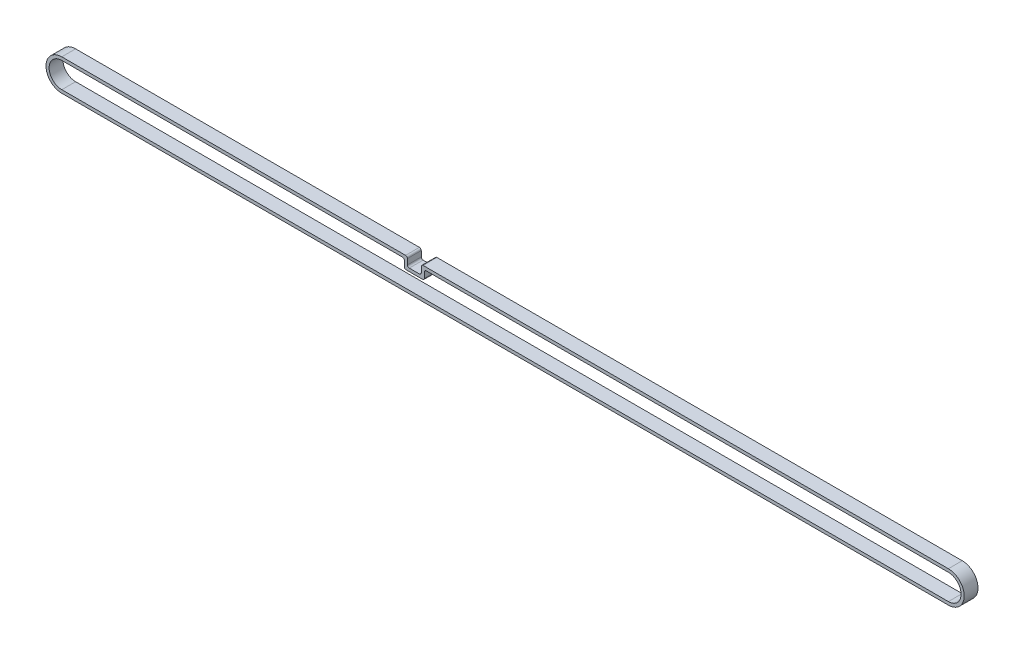
ISO-10303-21;
HEADER;
FILE_DESCRIPTION(('STEP AP214'),'2;1');
FILE_NAME('part.step','',(''),(''),'','','');
FILE_SCHEMA(('AUTOMOTIVE_DESIGN { 1 0 10303 214 1 1 1 1 }'));
ENDSEC;
DATA;
#1=APPLICATION_CONTEXT('core data for automotive mechanical design processes');
#2=APPLICATION_PROTOCOL_DEFINITION('international standard','automotive_design',2000,#1);
#3=PRODUCT_CONTEXT('',#1,'mechanical');
#4=PRODUCT('Part','Part','',(#3));
#5=PRODUCT_RELATED_PRODUCT_CATEGORY('part','',(#4));
#6=PRODUCT_DEFINITION_FORMATION('','',#4);
#7=PRODUCT_DEFINITION_CONTEXT('part definition',#1,'design');
#8=PRODUCT_DEFINITION('design','',#6,#7);
#9=PRODUCT_DEFINITION_SHAPE('','',#8);
#10=(LENGTH_UNIT() NAMED_UNIT(*) SI_UNIT(.MILLI.,.METRE.));
#11=(NAMED_UNIT(*) PLANE_ANGLE_UNIT() SI_UNIT($,.RADIAN.));
#12=(NAMED_UNIT(*) SI_UNIT($,.STERADIAN.) SOLID_ANGLE_UNIT());
#13=UNCERTAINTY_MEASURE_WITH_UNIT(LENGTH_MEASURE(1.E-05),#10,'distance_accuracy_value','');
#14=(GEOMETRIC_REPRESENTATION_CONTEXT(3) GLOBAL_UNCERTAINTY_ASSIGNED_CONTEXT((#13)) GLOBAL_UNIT_ASSIGNED_CONTEXT((#10,
#11,#12)) REPRESENTATION_CONTEXT('',''));
#15=CARTESIAN_POINT('',(0.,0.,0.));
#16=DIRECTION('',(0.,0.,1.));
#17=DIRECTION('',(1.,0.,0.));
#18=AXIS2_PLACEMENT_3D('',#15,#16,#17);
#19=CARTESIAN_POINT('',(0.,0.,6.));
#20=DIRECTION('',(0.,0.,1.));
#21=DIRECTION('',(1.,0.,0.));
#22=AXIS2_PLACEMENT_3D('',#19,#20,#21);
#23=PLANE('',#22);
#24=DIRECTION('',(-1.,0.,0.));
#25=VECTOR('',#24,1.);
#26=CARTESIAN_POINT('',(156.,6.85,6.));
#27=LINE('',#26,#25);
#28=CARTESIAN_POINT('',(384.75,6.85,6.));
#29=VERTEX_POINT('',#28);
#30=CARTESIAN_POINT('',(156.8,6.85,6.));
#31=VERTEX_POINT('',#30);
#32=EDGE_CURVE('E271',#29,#31,#27,.T.);
#33=ORIENTED_EDGE('',*,*,#32,.T.);
#34=CARTESIAN_POINT('',(156.8,6.05,6.));
#35=DIRECTION('',(0.,0.,1.));
#36=DIRECTION('',(1.,0.,0.));
#37=AXIS2_PLACEMENT_3D('',#34,#35,#36);
#38=CIRCLE('',#37,0.8);
#39=CARTESIAN_POINT('',(156.,6.05,6.));
#40=VERTEX_POINT('',#39);
#41=EDGE_CURVE('E343',#31,#40,#38,.T.);
#42=ORIENTED_EDGE('',*,*,#41,.T.);
#43=DIRECTION('',(0.,-1.,0.));
#44=VECTOR('',#43,1.);
#45=CARTESIAN_POINT('',(156.,2.85,6.));
#46=LINE('',#45,#44);
#47=CARTESIAN_POINT('',(156.,3.65,6.));
#48=VERTEX_POINT('',#47);
#49=EDGE_CURVE('E274',#40,#48,#46,.T.);
#50=ORIENTED_EDGE('',*,*,#49,.T.);
#51=CARTESIAN_POINT('',(155.2,3.65,6.));
#52=DIRECTION('',(0.,0.,1.));
#53=DIRECTION('',(1.,0.,0.));
#54=AXIS2_PLACEMENT_3D('',#51,#52,#53);
#55=CIRCLE('',#54,0.8);
#56=CARTESIAN_POINT('',(155.2,2.85,6.));
#57=VERTEX_POINT('',#56);
#58=EDGE_CURVE('E378',#48,#57,#55,.F.);
#59=ORIENTED_EDGE('',*,*,#58,.T.);
#60=DIRECTION('',(-1.,0.,0.));
#61=VECTOR('',#60,1.);
#62=CARTESIAN_POINT('',(150.,2.85,6.));
#63=LINE('',#62,#61);
#64=CARTESIAN_POINT('',(150.8,2.85,6.));
#65=VERTEX_POINT('',#64);
#66=EDGE_CURVE('E277',#57,#65,#63,.T.);
#67=ORIENTED_EDGE('',*,*,#66,.T.);
#68=CARTESIAN_POINT('',(150.8,3.65,6.));
#69=DIRECTION('',(0.,0.,1.));
#70=DIRECTION('',(1.,0.,0.));
#71=AXIS2_PLACEMENT_3D('',#68,#69,#70);
#72=CIRCLE('',#71,0.8);
#73=CARTESIAN_POINT('',(150.,3.65,6.));
#74=VERTEX_POINT('',#73);
#75=EDGE_CURVE('E11',#65,#74,#72,.F.);
#76=ORIENTED_EDGE('',*,*,#75,.T.);
#77=DIRECTION('',(0.,1.,0.));
#78=VECTOR('',#77,1.);
#79=CARTESIAN_POINT('',(150.,2.85,6.));
#80=LINE('',#79,#78);
#81=CARTESIAN_POINT('',(150.,6.05,6.));
#82=VERTEX_POINT('',#81);
#83=EDGE_CURVE('E280',#74,#82,#80,.T.);
#84=ORIENTED_EDGE('',*,*,#83,.T.);
#85=CARTESIAN_POINT('',(149.2,6.05,6.));
#86=DIRECTION('',(0.,0.,1.));
#87=DIRECTION('',(1.,0.,0.));
#88=AXIS2_PLACEMENT_3D('',#85,#86,#87);
#89=CIRCLE('',#88,0.8);
#90=CARTESIAN_POINT('',(149.2,6.85,6.));
#91=VERTEX_POINT('',#90);
#92=EDGE_CURVE('E49',#82,#91,#89,.T.);
#93=ORIENTED_EDGE('',*,*,#92,.T.);
#94=DIRECTION('',(-1.,0.,0.));
#95=VECTOR('',#94,1.);
#96=CARTESIAN_POINT('',(0.,6.85,6.));
#97=LINE('',#96,#95);
#98=CARTESIAN_POINT('',(0.,6.85,6.));
#99=VERTEX_POINT('',#98);
#100=EDGE_CURVE('E282',#91,#99,#97,.T.);
#101=ORIENTED_EDGE('',*,*,#100,.T.);
#102=CARTESIAN_POINT('',(0.,0.,6.));
#103=DIRECTION('',(0.,0.,1.));
#104=DIRECTION('',(1.,0.,0.));
#105=AXIS2_PLACEMENT_3D('',#102,#103,#104);
#106=CIRCLE('',#105,6.85);
#107=CARTESIAN_POINT('',(0.,-6.85,6.));
#108=VERTEX_POINT('',#107);
#109=EDGE_CURVE('E263',#99,#108,#106,.T.);
#110=ORIENTED_EDGE('',*,*,#109,.T.);
#111=DIRECTION('',(1.,0.,0.));
#112=VECTOR('',#111,1.);
#113=CARTESIAN_POINT('',(0.,-6.85,6.));
#114=LINE('',#113,#112);
#115=CARTESIAN_POINT('',(384.75,-6.85,6.));
#116=VERTEX_POINT('',#115);
#117=EDGE_CURVE('E266',#108,#116,#114,.T.);
#118=ORIENTED_EDGE('',*,*,#117,.T.);
#119=CARTESIAN_POINT('',(384.75,0.,6.));
#120=DIRECTION('',(0.,0.,1.));
#121=DIRECTION('',(-1.,0.,0.));
#122=AXIS2_PLACEMENT_3D('',#119,#120,#121);
#123=CIRCLE('',#122,6.85);
#124=EDGE_CURVE('E269',#116,#29,#123,.T.);
#125=ORIENTED_EDGE('',*,*,#124,.T.);
#126=EDGE_LOOP('',(#33,#42,#50,#59,#67,#76,#84,#93,#101,#110,#118,#125));
#127=FACE_BOUND('',#126,.T.);
#128=DIRECTION('',(0.,1.,0.));
#129=VECTOR('',#128,1.);
#130=CARTESIAN_POINT('',(148.65,5.5,6.));
#131=LINE('',#130,#129);
#132=CARTESIAN_POINT('',(148.65,2.3,6.));
#133=VERTEX_POINT('',#132);
#134=CARTESIAN_POINT('',(148.65,4.7,6.));
#135=VERTEX_POINT('',#134);
#136=EDGE_CURVE('E235',#133,#135,#131,.T.);
#137=ORIENTED_EDGE('',*,*,#136,.F.);
#138=CARTESIAN_POINT('',(149.45,2.3,6.));
#139=DIRECTION('',(0.,0.,1.));
#140=DIRECTION('',(1.,0.,0.));
#141=AXIS2_PLACEMENT_3D('',#138,#139,#140);
#142=CIRCLE('',#141,0.8);
#143=CARTESIAN_POINT('',(149.45,1.5,6.));
#144=VERTEX_POINT('',#143);
#145=EDGE_CURVE('E347',#133,#144,#142,.T.);
#146=ORIENTED_EDGE('',*,*,#145,.T.);
#147=DIRECTION('',(-1.,0.,0.));
#148=VECTOR('',#147,1.);
#149=CARTESIAN_POINT('',(148.65,1.5,6.));
#150=LINE('',#149,#148);
#151=CARTESIAN_POINT('',(156.55,1.5,6.));
#152=VERTEX_POINT('',#151);
#153=EDGE_CURVE('E232',#152,#144,#150,.T.);
#154=ORIENTED_EDGE('',*,*,#153,.F.);
#155=CARTESIAN_POINT('',(156.55,2.3,6.));
#156=DIRECTION('',(0.,0.,1.));
#157=DIRECTION('',(1.,0.,0.));
#158=AXIS2_PLACEMENT_3D('',#155,#156,#157);
#159=CIRCLE('',#158,0.8);
#160=CARTESIAN_POINT('',(157.35,2.3,6.));
#161=VERTEX_POINT('',#160);
#162=EDGE_CURVE('E345',#152,#161,#159,.T.);
#163=ORIENTED_EDGE('',*,*,#162,.T.);
#164=DIRECTION('',(0.,-1.,0.));
#165=VECTOR('',#164,1.);
#166=CARTESIAN_POINT('',(157.35,1.5,6.));
#167=LINE('',#166,#165);
#168=CARTESIAN_POINT('',(157.35,4.7,6.));
#169=VERTEX_POINT('',#168);
#170=EDGE_CURVE('E229',#169,#161,#167,.T.);
#171=ORIENTED_EDGE('',*,*,#170,.F.);
#172=CARTESIAN_POINT('',(158.15,4.7,6.));
#173=DIRECTION('',(0.,0.,1.));
#174=DIRECTION('',(1.,0.,0.));
#175=AXIS2_PLACEMENT_3D('',#172,#173,#174);
#176=CIRCLE('',#175,0.8);
#177=CARTESIAN_POINT('',(158.15,5.5,6.));
#178=VERTEX_POINT('',#177);
#179=EDGE_CURVE('E370',#169,#178,#176,.F.);
#180=ORIENTED_EDGE('',*,*,#179,.T.);
#181=DIRECTION('',(-1.,0.,0.));
#182=VECTOR('',#181,1.);
#183=CARTESIAN_POINT('',(157.35,5.5,6.));
#184=LINE('',#183,#182);
#185=CARTESIAN_POINT('',(384.75,5.5,6.));
#186=VERTEX_POINT('',#185);
#187=EDGE_CURVE('E224',#186,#178,#184,.T.);
#188=ORIENTED_EDGE('',*,*,#187,.F.);
#189=CARTESIAN_POINT('',(384.75,0.,6.));
#190=DIRECTION('',(0.,0.,1.));
#191=DIRECTION('',(-1.,0.,0.));
#192=AXIS2_PLACEMENT_3D('',#189,#190,#191);
#193=CIRCLE('',#192,5.5);
#194=CARTESIAN_POINT('',(384.75,-5.5,6.));
#195=VERTEX_POINT('',#194);
#196=EDGE_CURVE('E222',#195,#186,#193,.T.);
#197=ORIENTED_EDGE('',*,*,#196,.F.);
#198=DIRECTION('',(1.,0.,0.));
#199=VECTOR('',#198,1.);
#200=CARTESIAN_POINT('',(0.,-5.5,6.));
#201=LINE('',#200,#199);
#202=CARTESIAN_POINT('',(0.,-5.5,6.));
#203=VERTEX_POINT('',#202);
#204=EDGE_CURVE('E208',#203,#195,#201,.T.);
#205=ORIENTED_EDGE('',*,*,#204,.F.);
#206=CARTESIAN_POINT('',(0.,0.,6.));
#207=DIRECTION('',(0.,0.,1.));
#208=DIRECTION('',(1.,0.,0.));
#209=AXIS2_PLACEMENT_3D('',#206,#207,#208);
#210=CIRCLE('',#209,5.5);
#211=CARTESIAN_POINT('',(0.,5.5,6.));
#212=VERTEX_POINT('',#211);
#213=EDGE_CURVE('E197',#212,#203,#210,.T.);
#214=ORIENTED_EDGE('',*,*,#213,.F.);
#215=DIRECTION('',(-1.,0.,0.));
#216=VECTOR('',#215,1.);
#217=CARTESIAN_POINT('',(0.,5.5,6.));
#218=LINE('',#217,#216);
#219=CARTESIAN_POINT('',(147.85,5.5,6.));
#220=VERTEX_POINT('',#219);
#221=EDGE_CURVE('E238',#220,#212,#218,.T.);
#222=ORIENTED_EDGE('',*,*,#221,.F.);
#223=CARTESIAN_POINT('',(147.85,4.7,6.));
#224=DIRECTION('',(0.,0.,1.));
#225=DIRECTION('',(1.,0.,0.));
#226=AXIS2_PLACEMENT_3D('',#223,#224,#225);
#227=CIRCLE('',#226,0.8);
#228=EDGE_CURVE('E374',#220,#135,#227,.F.);
#229=ORIENTED_EDGE('',*,*,#228,.T.);
#230=EDGE_LOOP('',(#137,#146,#154,#163,#171,#180,#188,#197,#205,#214,#222,#229));
#231=FACE_BOUND('',#230,.T.);
#232=ADVANCED_FACE('F34',(#127,#231),#23,.T.);
#233=CARTESIAN_POINT('',(0.,0.,0.));
#234=DIRECTION('',(0.,0.,1.));
#235=DIRECTION('',(1.,0.,0.));
#236=AXIS2_PLACEMENT_3D('',#233,#234,#235);
#237=PLANE('',#236);
#238=DIRECTION('',(0.,-1.,0.));
#239=VECTOR('',#238,1.);
#240=CARTESIAN_POINT('',(156.,2.85,0.));
#241=LINE('',#240,#239);
#242=CARTESIAN_POINT('',(156.,6.05,0.));
#243=VERTEX_POINT('',#242);
#244=CARTESIAN_POINT('',(156.,3.65,0.));
#245=VERTEX_POINT('',#244);
#246=EDGE_CURVE('E294',#243,#245,#241,.T.);
#247=ORIENTED_EDGE('',*,*,#246,.F.);
#248=CARTESIAN_POINT('',(156.8,6.05,0.));
#249=DIRECTION('',(0.,0.,1.));
#250=DIRECTION('',(1.,0.,0.));
#251=AXIS2_PLACEMENT_3D('',#248,#249,#250);
#252=CIRCLE('',#251,0.8);
#253=CARTESIAN_POINT('',(156.8,6.85,0.));
#254=VERTEX_POINT('',#253);
#255=EDGE_CURVE('E336',#243,#254,#252,.F.);
#256=ORIENTED_EDGE('',*,*,#255,.T.);
#257=DIRECTION('',(-1.,0.,0.));
#258=VECTOR('',#257,1.);
#259=CARTESIAN_POINT('',(156.,6.85,0.));
#260=LINE('',#259,#258);
#261=CARTESIAN_POINT('',(384.75,6.85,0.));
#262=VERTEX_POINT('',#261);
#263=EDGE_CURVE('E291',#262,#254,#260,.T.);
#264=ORIENTED_EDGE('',*,*,#263,.F.);
#265=CARTESIAN_POINT('',(384.75,0.,0.));
#266=DIRECTION('',(0.,0.,1.));
#267=DIRECTION('',(-1.,0.,0.));
#268=AXIS2_PLACEMENT_3D('',#265,#266,#267);
#269=CIRCLE('',#268,6.85);
#270=CARTESIAN_POINT('',(384.75,-6.85,0.));
#271=VERTEX_POINT('',#270);
#272=EDGE_CURVE('E289',#271,#262,#269,.T.);
#273=ORIENTED_EDGE('',*,*,#272,.F.);
#274=DIRECTION('',(1.,0.,0.));
#275=VECTOR('',#274,1.);
#276=CARTESIAN_POINT('',(0.,-6.85,0.));
#277=LINE('',#276,#275);
#278=CARTESIAN_POINT('',(0.,-6.85,0.));
#279=VERTEX_POINT('',#278);
#280=EDGE_CURVE('E287',#279,#271,#277,.T.);
#281=ORIENTED_EDGE('',*,*,#280,.F.);
#282=CARTESIAN_POINT('',(0.,0.,0.));
#283=DIRECTION('',(0.,0.,1.));
#284=DIRECTION('',(1.,0.,0.));
#285=AXIS2_PLACEMENT_3D('',#282,#283,#284);
#286=CIRCLE('',#285,6.85);
#287=CARTESIAN_POINT('',(0.,6.85,0.));
#288=VERTEX_POINT('',#287);
#289=EDGE_CURVE('E216',#288,#279,#286,.T.);
#290=ORIENTED_EDGE('',*,*,#289,.F.);
#291=DIRECTION('',(-1.,0.,0.));
#292=VECTOR('',#291,1.);
#293=CARTESIAN_POINT('',(0.,6.85,0.));
#294=LINE('',#293,#292);
#295=CARTESIAN_POINT('',(149.2,6.85,0.));
#296=VERTEX_POINT('',#295);
#297=EDGE_CURVE('E267',#296,#288,#294,.T.);
#298=ORIENTED_EDGE('',*,*,#297,.F.);
#299=CARTESIAN_POINT('',(149.2,6.05,0.));
#300=DIRECTION('',(0.,0.,1.));
#301=DIRECTION('',(1.,0.,0.));
#302=AXIS2_PLACEMENT_3D('',#299,#300,#301);
#303=CIRCLE('',#302,0.8);
#304=CARTESIAN_POINT('',(150.,6.05,0.));
#305=VERTEX_POINT('',#304);
#306=EDGE_CURVE('E334',#296,#305,#303,.F.);
#307=ORIENTED_EDGE('',*,*,#306,.T.);
#308=DIRECTION('',(0.,1.,0.));
#309=VECTOR('',#308,1.);
#310=CARTESIAN_POINT('',(150.,2.85,0.));
#311=LINE('',#310,#309);
#312=CARTESIAN_POINT('',(150.,3.65,0.));
#313=VERTEX_POINT('',#312);
#314=EDGE_CURVE('E300',#313,#305,#311,.T.);
#315=ORIENTED_EDGE('',*,*,#314,.F.);
#316=CARTESIAN_POINT('',(150.8,3.65,0.));
#317=DIRECTION('',(0.,0.,1.));
#318=DIRECTION('',(1.,0.,0.));
#319=AXIS2_PLACEMENT_3D('',#316,#317,#318);
#320=CIRCLE('',#319,0.8);
#321=CARTESIAN_POINT('',(150.8,2.85,0.));
#322=VERTEX_POINT('',#321);
#323=EDGE_CURVE('E42',#313,#322,#320,.T.);
#324=ORIENTED_EDGE('',*,*,#323,.T.);
#325=DIRECTION('',(-1.,0.,0.));
#326=VECTOR('',#325,1.);
#327=CARTESIAN_POINT('',(150.,2.85,0.));
#328=LINE('',#327,#326);
#329=CARTESIAN_POINT('',(155.2,2.85,0.));
#330=VERTEX_POINT('',#329);
#331=EDGE_CURVE('E297',#330,#322,#328,.T.);
#332=ORIENTED_EDGE('',*,*,#331,.F.);
#333=CARTESIAN_POINT('',(155.2,3.65,0.));
#334=DIRECTION('',(0.,0.,1.));
#335=DIRECTION('',(1.,0.,0.));
#336=AXIS2_PLACEMENT_3D('',#333,#334,#335);
#337=CIRCLE('',#336,0.8);
#338=EDGE_CURVE('E376',#330,#245,#337,.T.);
#339=ORIENTED_EDGE('',*,*,#338,.T.);
#340=EDGE_LOOP('',(#247,#256,#264,#273,#281,#290,#298,#307,#315,#324,#332,#339));
#341=FACE_BOUND('',#340,.T.);
#342=DIRECTION('',(-1.,0.,0.));
#343=VECTOR('',#342,1.);
#344=CARTESIAN_POINT('',(148.65,1.5,0.));
#345=LINE('',#344,#343);
#346=CARTESIAN_POINT('',(156.55,1.5,0.));
#347=VERTEX_POINT('',#346);
#348=CARTESIAN_POINT('',(149.45,1.5,0.));
#349=VERTEX_POINT('',#348);
#350=EDGE_CURVE('E252',#347,#349,#345,.T.);
#351=ORIENTED_EDGE('',*,*,#350,.T.);
#352=CARTESIAN_POINT('',(149.45,2.3,0.));
#353=DIRECTION('',(0.,0.,1.));
#354=DIRECTION('',(1.,0.,0.));
#355=AXIS2_PLACEMENT_3D('',#352,#353,#354);
#356=CIRCLE('',#355,0.8);
#357=CARTESIAN_POINT('',(148.65,2.3,0.));
#358=VERTEX_POINT('',#357);
#359=EDGE_CURVE('E340',#349,#358,#356,.F.);
#360=ORIENTED_EDGE('',*,*,#359,.T.);
#361=DIRECTION('',(0.,1.,0.));
#362=VECTOR('',#361,1.);
#363=CARTESIAN_POINT('',(148.65,5.5,0.));
#364=LINE('',#363,#362);
#365=CARTESIAN_POINT('',(148.65,4.7,0.));
#366=VERTEX_POINT('',#365);
#367=EDGE_CURVE('E255',#358,#366,#364,.T.);
#368=ORIENTED_EDGE('',*,*,#367,.T.);
#369=CARTESIAN_POINT('',(147.85,4.7,0.));
#370=DIRECTION('',(0.,0.,1.));
#371=DIRECTION('',(1.,0.,0.));
#372=AXIS2_PLACEMENT_3D('',#369,#370,#371);
#373=CIRCLE('',#372,0.8);
#374=CARTESIAN_POINT('',(147.85,5.5,0.));
#375=VERTEX_POINT('',#374);
#376=EDGE_CURVE('E372',#366,#375,#373,.T.);
#377=ORIENTED_EDGE('',*,*,#376,.T.);
#378=DIRECTION('',(-1.,0.,0.));
#379=VECTOR('',#378,1.);
#380=CARTESIAN_POINT('',(0.,5.5,0.));
#381=LINE('',#380,#379);
#382=CARTESIAN_POINT('',(0.,5.5,0.));
#383=VERTEX_POINT('',#382);
#384=EDGE_CURVE('E209',#375,#383,#381,.T.);
#385=ORIENTED_EDGE('',*,*,#384,.T.);
#386=CARTESIAN_POINT('',(0.,0.,0.));
#387=DIRECTION('',(0.,0.,1.));
#388=DIRECTION('',(1.,0.,0.));
#389=AXIS2_PLACEMENT_3D('',#386,#387,#388);
#390=CIRCLE('',#389,5.5);
#391=CARTESIAN_POINT('',(0.,-5.5,0.));
#392=VERTEX_POINT('',#391);
#393=EDGE_CURVE('E240',#383,#392,#390,.T.);
#394=ORIENTED_EDGE('',*,*,#393,.T.);
#395=DIRECTION('',(1.,0.,0.));
#396=VECTOR('',#395,1.);
#397=CARTESIAN_POINT('',(0.,-5.5,0.));
#398=LINE('',#397,#396);
#399=CARTESIAN_POINT('',(384.75,-5.5,0.));
#400=VERTEX_POINT('',#399);
#401=EDGE_CURVE('E215',#392,#400,#398,.T.);
#402=ORIENTED_EDGE('',*,*,#401,.T.);
#403=CARTESIAN_POINT('',(384.75,0.,0.));
#404=DIRECTION('',(0.,0.,1.));
#405=DIRECTION('',(-1.,0.,0.));
#406=AXIS2_PLACEMENT_3D('',#403,#404,#405);
#407=CIRCLE('',#406,5.5);
#408=CARTESIAN_POINT('',(384.75,5.5,0.));
#409=VERTEX_POINT('',#408);
#410=EDGE_CURVE('E243',#400,#409,#407,.T.);
#411=ORIENTED_EDGE('',*,*,#410,.T.);
#412=DIRECTION('',(-1.,0.,0.));
#413=VECTOR('',#412,1.);
#414=CARTESIAN_POINT('',(157.35,5.5,0.));
#415=LINE('',#414,#413);
#416=CARTESIAN_POINT('',(158.15,5.5,0.));
#417=VERTEX_POINT('',#416);
#418=EDGE_CURVE('E246',#409,#417,#415,.T.);
#419=ORIENTED_EDGE('',*,*,#418,.T.);
#420=CARTESIAN_POINT('',(158.15,4.7,0.));
#421=DIRECTION('',(0.,0.,1.));
#422=DIRECTION('',(1.,0.,0.));
#423=AXIS2_PLACEMENT_3D('',#420,#421,#422);
#424=CIRCLE('',#423,0.8);
#425=CARTESIAN_POINT('',(157.35,4.7,0.));
#426=VERTEX_POINT('',#425);
#427=EDGE_CURVE('E368',#417,#426,#424,.T.);
#428=ORIENTED_EDGE('',*,*,#427,.T.);
#429=DIRECTION('',(0.,-1.,0.));
#430=VECTOR('',#429,1.);
#431=CARTESIAN_POINT('',(157.35,1.5,0.));
#432=LINE('',#431,#430);
#433=CARTESIAN_POINT('',(157.35,2.3,0.));
#434=VERTEX_POINT('',#433);
#435=EDGE_CURVE('E249',#426,#434,#432,.T.);
#436=ORIENTED_EDGE('',*,*,#435,.T.);
#437=CARTESIAN_POINT('',(156.55,2.3,0.));
#438=DIRECTION('',(0.,0.,1.));
#439=DIRECTION('',(1.,0.,0.));
#440=AXIS2_PLACEMENT_3D('',#437,#438,#439);
#441=CIRCLE('',#440,0.8);
#442=EDGE_CURVE('E338',#434,#347,#441,.F.);
#443=ORIENTED_EDGE('',*,*,#442,.T.);
#444=EDGE_LOOP('',(#351,#360,#368,#377,#385,#394,#402,#411,#419,#428,#436,#443));
#445=FACE_BOUND('',#444,.T.);
#446=ADVANCED_FACE('F383',(#341,#445),#237,.F.);
#447=CARTESIAN_POINT('',(0.,0.,6.));
#448=DIRECTION('',(0.,0.,-1.));
#449=DIRECTION('',(-1.,0.,0.));
#450=AXIS2_PLACEMENT_3D('',#447,#448,#449);
#451=CYLINDRICAL_SURFACE('',#450,6.85);
#452=ORIENTED_EDGE('',*,*,#289,.T.);
#453=DIRECTION('',(0.,0.,-1.));
#454=VECTOR('',#453,1.);
#455=CARTESIAN_POINT('',(0.,-6.85,6.));
#456=LINE('',#455,#454);
#457=EDGE_CURVE('E311',#108,#279,#456,.T.);
#458=ORIENTED_EDGE('',*,*,#457,.F.);
#459=ORIENTED_EDGE('',*,*,#109,.F.);
#460=DIRECTION('',(0.,0.,-1.));
#461=VECTOR('',#460,1.);
#462=CARTESIAN_POINT('',(0.,6.85,6.));
#463=LINE('',#462,#461);
#464=EDGE_CURVE('E284',#99,#288,#463,.T.);
#465=ORIENTED_EDGE('',*,*,#464,.T.);
#466=EDGE_LOOP('',(#452,#458,#459,#465));
#467=FACE_BOUND('',#466,.T.);
#468=ADVANCED_FACE('F405',(#467),#451,.T.);
#469=CARTESIAN_POINT('',(0.,-6.85,6.));
#470=DIRECTION('',(0.,1.,0.));
#471=DIRECTION('',(0.,0.,1.));
#472=AXIS2_PLACEMENT_3D('',#469,#470,#471);
#473=PLANE('',#472);
#474=ORIENTED_EDGE('',*,*,#280,.T.);
#475=DIRECTION('',(0.,0.,-1.));
#476=VECTOR('',#475,1.);
#477=CARTESIAN_POINT('',(384.75,-6.85,6.));
#478=LINE('',#477,#476);
#479=EDGE_CURVE('E308',#116,#271,#478,.T.);
#480=ORIENTED_EDGE('',*,*,#479,.F.);
#481=ORIENTED_EDGE('',*,*,#117,.F.);
#482=ORIENTED_EDGE('',*,*,#457,.T.);
#483=EDGE_LOOP('',(#474,#480,#481,#482));
#484=FACE_BOUND('',#483,.T.);
#485=ADVANCED_FACE('F411',(#484),#473,.F.);
#486=CARTESIAN_POINT('',(384.75,0.,6.));
#487=DIRECTION('',(0.,0.,-1.));
#488=DIRECTION('',(-1.,0.,0.));
#489=AXIS2_PLACEMENT_3D('',#486,#487,#488);
#490=CYLINDRICAL_SURFACE('',#489,6.85);
#491=ORIENTED_EDGE('',*,*,#272,.T.);
#492=DIRECTION('',(0.,0.,-1.));
#493=VECTOR('',#492,1.);
#494=CARTESIAN_POINT('',(384.75,6.85,6.));
#495=LINE('',#494,#493);
#496=EDGE_CURVE('E305',#29,#262,#495,.T.);
#497=ORIENTED_EDGE('',*,*,#496,.F.);
#498=ORIENTED_EDGE('',*,*,#124,.F.);
#499=ORIENTED_EDGE('',*,*,#479,.T.);
#500=EDGE_LOOP('',(#491,#497,#498,#499));
#501=FACE_BOUND('',#500,.T.);
#502=ADVANCED_FACE('F413',(#501),#490,.T.);
#503=CARTESIAN_POINT('',(156.,6.85,6.));
#504=DIRECTION('',(0.,-1.,0.));
#505=DIRECTION('',(0.,0.,-1.));
#506=AXIS2_PLACEMENT_3D('',#503,#504,#505);
#507=PLANE('',#506);
#508=ORIENTED_EDGE('',*,*,#263,.T.);
#509=DIRECTION('',(0.,0.,-1.));
#510=VECTOR('',#509,1.);
#511=CARTESIAN_POINT('',(156.8,6.85,6.));
#512=LINE('',#511,#510);
#513=EDGE_CURVE('E359',#254,#31,#512,.F.);
#514=ORIENTED_EDGE('',*,*,#513,.T.);
#515=ORIENTED_EDGE('',*,*,#32,.F.);
#516=ORIENTED_EDGE('',*,*,#496,.T.);
#517=EDGE_LOOP('',(#508,#514,#515,#516));
#518=FACE_BOUND('',#517,.T.);
#519=ADVANCED_FACE('F417',(#518),#507,.F.);
#520=CARTESIAN_POINT('',(156.,2.85,6.));
#521=DIRECTION('',(1.,0.,0.));
#522=DIRECTION('',(0.,0.,-1.));
#523=AXIS2_PLACEMENT_3D('',#520,#521,#522);
#524=PLANE('',#523);
#525=ORIENTED_EDGE('',*,*,#246,.T.);
#526=DIRECTION('',(0.,0.,-1.));
#527=VECTOR('',#526,1.);
#528=CARTESIAN_POINT('',(156.,3.65,6.));
#529=LINE('',#528,#527);
#530=EDGE_CURVE('E357',#245,#48,#529,.F.);
#531=ORIENTED_EDGE('',*,*,#530,.T.);
#532=ORIENTED_EDGE('',*,*,#49,.F.);
#533=DIRECTION('',(0.,0.,-1.));
#534=VECTOR('',#533,1.);
#535=CARTESIAN_POINT('',(156.,6.05,6.));
#536=LINE('',#535,#534);
#537=EDGE_CURVE('E354',#40,#243,#536,.T.);
#538=ORIENTED_EDGE('',*,*,#537,.T.);
#539=EDGE_LOOP('',(#525,#531,#532,#538));
#540=FACE_BOUND('',#539,.T.);
#541=ADVANCED_FACE('F425',(#540),#524,.F.);
#542=CARTESIAN_POINT('',(150.,2.85,6.));
#543=DIRECTION('',(0.,-1.,0.));
#544=DIRECTION('',(0.,0.,-1.));
#545=AXIS2_PLACEMENT_3D('',#542,#543,#544);
#546=PLANE('',#545);
#547=ORIENTED_EDGE('',*,*,#66,.F.);
#548=DIRECTION('',(0.,0.,-1.));
#549=VECTOR('',#548,1.);
#550=CARTESIAN_POINT('',(155.2,2.85,0.));
#551=LINE('',#550,#549);
#552=EDGE_CURVE('E351',#57,#330,#551,.T.);
#553=ORIENTED_EDGE('',*,*,#552,.T.);
#554=ORIENTED_EDGE('',*,*,#331,.T.);
#555=DIRECTION('',(0.,0.,-1.));
#556=VECTOR('',#555,1.);
#557=CARTESIAN_POINT('',(150.8,2.85,6.));
#558=LINE('',#557,#556);
#559=EDGE_CURVE('E349',#322,#65,#558,.F.);
#560=ORIENTED_EDGE('',*,*,#559,.T.);
#561=EDGE_LOOP('',(#547,#553,#554,#560));
#562=FACE_BOUND('',#561,.T.);
#563=ADVANCED_FACE('F390',(#562),#546,.F.);
#564=CARTESIAN_POINT('',(150.,2.85,6.));
#565=DIRECTION('',(-1.,0.,0.));
#566=DIRECTION('',(0.,0.,1.));
#567=AXIS2_PLACEMENT_3D('',#564,#565,#566);
#568=PLANE('',#567);
#569=ORIENTED_EDGE('',*,*,#314,.T.);
#570=DIRECTION('',(0.,0.,-1.));
#571=VECTOR('',#570,1.);
#572=CARTESIAN_POINT('',(150.,6.05,6.));
#573=LINE('',#572,#571);
#574=EDGE_CURVE('E57',#305,#82,#573,.F.);
#575=ORIENTED_EDGE('',*,*,#574,.T.);
#576=ORIENTED_EDGE('',*,*,#83,.F.);
#577=DIRECTION('',(0.,0.,-1.));
#578=VECTOR('',#577,1.);
#579=CARTESIAN_POINT('',(150.,3.65,0.));
#580=LINE('',#579,#578);
#581=EDGE_CURVE('E364',#74,#313,#580,.T.);
#582=ORIENTED_EDGE('',*,*,#581,.T.);
#583=EDGE_LOOP('',(#569,#575,#576,#582));
#584=FACE_BOUND('',#583,.T.);
#585=ADVANCED_FACE('F393',(#584),#568,.F.);
#586=CARTESIAN_POINT('',(0.,6.85,6.));
#587=DIRECTION('',(0.,-1.,0.));
#588=DIRECTION('',(0.,0.,-1.));
#589=AXIS2_PLACEMENT_3D('',#586,#587,#588);
#590=PLANE('',#589);
#591=ORIENTED_EDGE('',*,*,#100,.F.);
#592=DIRECTION('',(0.,0.,-1.));
#593=VECTOR('',#592,1.);
#594=CARTESIAN_POINT('',(149.2,6.85,6.));
#595=LINE('',#594,#593);
#596=EDGE_CURVE('E361',#91,#296,#595,.T.);
#597=ORIENTED_EDGE('',*,*,#596,.T.);
#598=ORIENTED_EDGE('',*,*,#297,.T.);
#599=ORIENTED_EDGE('',*,*,#464,.F.);
#600=EDGE_LOOP('',(#591,#597,#598,#599));
#601=FACE_BOUND('',#600,.T.);
#602=ADVANCED_FACE('F399',(#601),#590,.F.);
#603=CARTESIAN_POINT('',(0.,0.,6.));
#604=DIRECTION('',(0.,0.,-1.));
#605=DIRECTION('',(-1.,0.,0.));
#606=AXIS2_PLACEMENT_3D('',#603,#604,#605);
#607=CYLINDRICAL_SURFACE('',#606,5.5);
#608=ORIENTED_EDGE('',*,*,#393,.F.);
#609=DIRECTION('',(0.,0.,-1.));
#610=VECTOR('',#609,1.);
#611=CARTESIAN_POINT('',(0.,5.5,6.));
#612=LINE('',#611,#610);
#613=EDGE_CURVE('E204',#212,#383,#612,.T.);
#614=ORIENTED_EDGE('',*,*,#613,.F.);
#615=ORIENTED_EDGE('',*,*,#213,.T.);
#616=DIRECTION('',(0.,0.,-1.));
#617=VECTOR('',#616,1.);
#618=CARTESIAN_POINT('',(0.,-5.5,6.));
#619=LINE('',#618,#617);
#620=EDGE_CURVE('E201',#203,#392,#619,.T.);
#621=ORIENTED_EDGE('',*,*,#620,.T.);
#622=EDGE_LOOP('',(#608,#614,#615,#621));
#623=FACE_BOUND('',#622,.T.);
#624=ADVANCED_FACE('F200',(#623),#607,.F.);
#625=CARTESIAN_POINT('',(0.,-5.5,6.));
#626=DIRECTION('',(0.,1.,0.));
#627=DIRECTION('',(0.,0.,1.));
#628=AXIS2_PLACEMENT_3D('',#625,#626,#627);
#629=PLANE('',#628);
#630=ORIENTED_EDGE('',*,*,#401,.F.);
#631=ORIENTED_EDGE('',*,*,#620,.F.);
#632=ORIENTED_EDGE('',*,*,#204,.T.);
#633=DIRECTION('',(0.,0.,-1.));
#634=VECTOR('',#633,1.);
#635=CARTESIAN_POINT('',(384.75,-5.5,6.));
#636=LINE('',#635,#634);
#637=EDGE_CURVE('E217',#195,#400,#636,.T.);
#638=ORIENTED_EDGE('',*,*,#637,.T.);
#639=EDGE_LOOP('',(#630,#631,#632,#638));
#640=FACE_BOUND('',#639,.T.);
#641=ADVANCED_FACE('F212',(#640),#629,.T.);
#642=CARTESIAN_POINT('',(384.75,0.,6.));
#643=DIRECTION('',(0.,0.,-1.));
#644=DIRECTION('',(-1.,0.,0.));
#645=AXIS2_PLACEMENT_3D('',#642,#643,#644);
#646=CYLINDRICAL_SURFACE('',#645,5.5);
#647=ORIENTED_EDGE('',*,*,#410,.F.);
#648=ORIENTED_EDGE('',*,*,#637,.F.);
#649=ORIENTED_EDGE('',*,*,#196,.T.);
#650=DIRECTION('',(0.,0.,-1.));
#651=VECTOR('',#650,1.);
#652=CARTESIAN_POINT('',(384.75,5.5,6.));
#653=LINE('',#652,#651);
#654=EDGE_CURVE('E260',#186,#409,#653,.T.);
#655=ORIENTED_EDGE('',*,*,#654,.T.);
#656=EDGE_LOOP('',(#647,#648,#649,#655));
#657=FACE_BOUND('',#656,.T.);
#658=ADVANCED_FACE('F506',(#657),#646,.F.);
#659=CARTESIAN_POINT('',(157.35,5.5,6.));
#660=DIRECTION('',(0.,-1.,0.));
#661=DIRECTION('',(1.,0.,0.));
#662=AXIS2_PLACEMENT_3D('',#659,#660,#661);
#663=PLANE('',#662);
#664=ORIENTED_EDGE('',*,*,#187,.T.);
#665=DIRECTION('',(0.,0.,-1.));
#666=VECTOR('',#665,1.);
#667=CARTESIAN_POINT('',(158.15,5.5,0.));
#668=LINE('',#667,#666);
#669=EDGE_CURVE('E314',#178,#417,#668,.T.);
#670=ORIENTED_EDGE('',*,*,#669,.T.);
#671=ORIENTED_EDGE('',*,*,#418,.F.);
#672=ORIENTED_EDGE('',*,*,#654,.F.);
#673=EDGE_LOOP('',(#664,#670,#671,#672));
#674=FACE_BOUND('',#673,.T.);
#675=ADVANCED_FACE('F502',(#674),#663,.T.);
#676=CARTESIAN_POINT('',(157.35,1.5,6.));
#677=DIRECTION('',(1.,0.,0.));
#678=DIRECTION('',(0.,0.,-1.));
#679=AXIS2_PLACEMENT_3D('',#676,#677,#678);
#680=PLANE('',#679);
#681=ORIENTED_EDGE('',*,*,#435,.F.);
#682=DIRECTION('',(0.,0.,-1.));
#683=VECTOR('',#682,1.);
#684=CARTESIAN_POINT('',(157.35,4.7,6.));
#685=LINE('',#684,#683);
#686=EDGE_CURVE('E320',#426,#169,#685,.F.);
#687=ORIENTED_EDGE('',*,*,#686,.T.);
#688=ORIENTED_EDGE('',*,*,#170,.T.);
#689=DIRECTION('',(0.,0.,-1.));
#690=VECTOR('',#689,1.);
#691=CARTESIAN_POINT('',(157.35,2.3,6.));
#692=LINE('',#691,#690);
#693=EDGE_CURVE('E317',#161,#434,#692,.T.);
#694=ORIENTED_EDGE('',*,*,#693,.T.);
#695=EDGE_LOOP('',(#681,#687,#688,#694));
#696=FACE_BOUND('',#695,.T.);
#697=ADVANCED_FACE('F497',(#696),#680,.T.);
#698=CARTESIAN_POINT('',(148.65,1.5,6.));
#699=DIRECTION('',(0.,-1.,0.));
#700=DIRECTION('',(0.,0.,-1.));
#701=AXIS2_PLACEMENT_3D('',#698,#699,#700);
#702=PLANE('',#701);
#703=ORIENTED_EDGE('',*,*,#153,.T.);
#704=DIRECTION('',(0.,0.,-1.));
#705=VECTOR('',#704,1.);
#706=CARTESIAN_POINT('',(149.45,1.5,6.));
#707=LINE('',#706,#705);
#708=EDGE_CURVE('E331',#144,#349,#707,.T.);
#709=ORIENTED_EDGE('',*,*,#708,.T.);
#710=ORIENTED_EDGE('',*,*,#350,.F.);
#711=DIRECTION('',(0.,0.,-1.));
#712=VECTOR('',#711,1.);
#713=CARTESIAN_POINT('',(156.55,1.5,6.));
#714=LINE('',#713,#712);
#715=EDGE_CURVE('E329',#347,#152,#714,.F.);
#716=ORIENTED_EDGE('',*,*,#715,.T.);
#717=EDGE_LOOP('',(#703,#709,#710,#716));
#718=FACE_BOUND('',#717,.T.);
#719=ADVANCED_FACE('F489',(#718),#702,.T.);
#720=CARTESIAN_POINT('',(148.65,5.5,6.));
#721=DIRECTION('',(-1.,0.,0.));
#722=DIRECTION('',(0.,0.,1.));
#723=AXIS2_PLACEMENT_3D('',#720,#721,#722);
#724=PLANE('',#723);
#725=ORIENTED_EDGE('',*,*,#136,.T.);
#726=DIRECTION('',(0.,0.,-1.));
#727=VECTOR('',#726,1.);
#728=CARTESIAN_POINT('',(148.65,4.7,0.));
#729=LINE('',#728,#727);
#730=EDGE_CURVE('E324',#135,#366,#729,.T.);
#731=ORIENTED_EDGE('',*,*,#730,.T.);
#732=ORIENTED_EDGE('',*,*,#367,.F.);
#733=DIRECTION('',(0.,0.,-1.));
#734=VECTOR('',#733,1.);
#735=CARTESIAN_POINT('',(148.65,2.3,6.));
#736=LINE('',#735,#734);
#737=EDGE_CURVE('E322',#358,#133,#736,.F.);
#738=ORIENTED_EDGE('',*,*,#737,.T.);
#739=EDGE_LOOP('',(#725,#731,#732,#738));
#740=FACE_BOUND('',#739,.T.);
#741=ADVANCED_FACE('F482',(#740),#724,.T.);
#742=CARTESIAN_POINT('',(0.,5.5,6.));
#743=DIRECTION('',(0.,-1.,0.));
#744=DIRECTION('',(0.,0.,-1.));
#745=AXIS2_PLACEMENT_3D('',#742,#743,#744);
#746=PLANE('',#745);
#747=ORIENTED_EDGE('',*,*,#384,.F.);
#748=DIRECTION('',(0.,0.,-1.));
#749=VECTOR('',#748,1.);
#750=CARTESIAN_POINT('',(147.85,5.5,6.));
#751=LINE('',#750,#749);
#752=EDGE_CURVE('E327',#375,#220,#751,.F.);
#753=ORIENTED_EDGE('',*,*,#752,.T.);
#754=ORIENTED_EDGE('',*,*,#221,.T.);
#755=ORIENTED_EDGE('',*,*,#613,.T.);
#756=EDGE_LOOP('',(#747,#753,#754,#755));
#757=FACE_BOUND('',#756,.T.);
#758=ADVANCED_FACE('F471',(#757),#746,.T.);
#759=CARTESIAN_POINT('',(158.15,4.7,6.));
#760=DIRECTION('',(0.,0.,1.));
#761=DIRECTION('',(1.,0.,0.));
#762=AXIS2_PLACEMENT_3D('',#759,#760,#761);
#763=CYLINDRICAL_SURFACE('',#762,0.8);
#764=ORIENTED_EDGE('',*,*,#179,.F.);
#765=ORIENTED_EDGE('',*,*,#686,.F.);
#766=ORIENTED_EDGE('',*,*,#427,.F.);
#767=ORIENTED_EDGE('',*,*,#669,.F.);
#768=EDGE_LOOP('',(#764,#765,#766,#767));
#769=FACE_BOUND('',#768,.T.);
#770=ADVANCED_FACE('F468',(#769),#763,.F.);
#771=CARTESIAN_POINT('',(147.85,4.7,6.));
#772=DIRECTION('',(0.,0.,1.));
#773=DIRECTION('',(1.,0.,0.));
#774=AXIS2_PLACEMENT_3D('',#771,#772,#773);
#775=CYLINDRICAL_SURFACE('',#774,0.8);
#776=ORIENTED_EDGE('',*,*,#228,.F.);
#777=ORIENTED_EDGE('',*,*,#752,.F.);
#778=ORIENTED_EDGE('',*,*,#376,.F.);
#779=ORIENTED_EDGE('',*,*,#730,.F.);
#780=EDGE_LOOP('',(#776,#777,#778,#779));
#781=FACE_BOUND('',#780,.T.);
#782=ADVANCED_FACE('F440',(#781),#775,.F.);
#783=CARTESIAN_POINT('',(149.45,2.3,6.));
#784=DIRECTION('',(0.,0.,-1.));
#785=DIRECTION('',(-1.,0.,0.));
#786=AXIS2_PLACEMENT_3D('',#783,#784,#785);
#787=CYLINDRICAL_SURFACE('',#786,0.8);
#788=ORIENTED_EDGE('',*,*,#145,.F.);
#789=ORIENTED_EDGE('',*,*,#737,.F.);
#790=ORIENTED_EDGE('',*,*,#359,.F.);
#791=ORIENTED_EDGE('',*,*,#708,.F.);
#792=EDGE_LOOP('',(#788,#789,#790,#791));
#793=FACE_BOUND('',#792,.T.);
#794=ADVANCED_FACE('F432',(#793),#787,.T.);
#795=CARTESIAN_POINT('',(155.2,3.65,6.));
#796=DIRECTION('',(0.,0.,1.));
#797=DIRECTION('',(1.,0.,0.));
#798=AXIS2_PLACEMENT_3D('',#795,#796,#797);
#799=CYLINDRICAL_SURFACE('',#798,0.8);
#800=ORIENTED_EDGE('',*,*,#58,.F.);
#801=ORIENTED_EDGE('',*,*,#530,.F.);
#802=ORIENTED_EDGE('',*,*,#338,.F.);
#803=ORIENTED_EDGE('',*,*,#552,.F.);
#804=EDGE_LOOP('',(#800,#801,#802,#803));
#805=FACE_BOUND('',#804,.T.);
#806=ADVANCED_FACE('F429',(#805),#799,.F.);
#807=CARTESIAN_POINT('',(156.55,2.3,6.));
#808=DIRECTION('',(0.,0.,-1.));
#809=DIRECTION('',(-1.,0.,0.));
#810=AXIS2_PLACEMENT_3D('',#807,#808,#809);
#811=CYLINDRICAL_SURFACE('',#810,0.8);
#812=ORIENTED_EDGE('',*,*,#162,.F.);
#813=ORIENTED_EDGE('',*,*,#715,.F.);
#814=ORIENTED_EDGE('',*,*,#442,.F.);
#815=ORIENTED_EDGE('',*,*,#693,.F.);
#816=EDGE_LOOP('',(#812,#813,#814,#815));
#817=FACE_BOUND('',#816,.T.);
#818=ADVANCED_FACE('F431',(#817),#811,.T.);
#819=CARTESIAN_POINT('',(156.8,6.05,6.));
#820=DIRECTION('',(0.,0.,-1.));
#821=DIRECTION('',(-1.,0.,0.));
#822=AXIS2_PLACEMENT_3D('',#819,#820,#821);
#823=CYLINDRICAL_SURFACE('',#822,0.8);
#824=ORIENTED_EDGE('',*,*,#41,.F.);
#825=ORIENTED_EDGE('',*,*,#513,.F.);
#826=ORIENTED_EDGE('',*,*,#255,.F.);
#827=ORIENTED_EDGE('',*,*,#537,.F.);
#828=EDGE_LOOP('',(#824,#825,#826,#827));
#829=FACE_BOUND('',#828,.T.);
#830=ADVANCED_FACE('F423',(#829),#823,.T.);
#831=CARTESIAN_POINT('',(149.2,6.05,6.));
#832=DIRECTION('',(0.,0.,-1.));
#833=DIRECTION('',(-1.,0.,0.));
#834=AXIS2_PLACEMENT_3D('',#831,#832,#833);
#835=CYLINDRICAL_SURFACE('',#834,0.8);
#836=ORIENTED_EDGE('',*,*,#92,.F.);
#837=ORIENTED_EDGE('',*,*,#574,.F.);
#838=ORIENTED_EDGE('',*,*,#306,.F.);
#839=ORIENTED_EDGE('',*,*,#596,.F.);
#840=EDGE_LOOP('',(#836,#837,#838,#839));
#841=FACE_BOUND('',#840,.T.);
#842=ADVANCED_FACE('F395',(#841),#835,.T.);
#843=CARTESIAN_POINT('',(150.8,3.65,6.));
#844=DIRECTION('',(0.,0.,1.));
#845=DIRECTION('',(1.,0.,0.));
#846=AXIS2_PLACEMENT_3D('',#843,#844,#845);
#847=CYLINDRICAL_SURFACE('',#846,0.8);
#848=ORIENTED_EDGE('',*,*,#75,.F.);
#849=ORIENTED_EDGE('',*,*,#559,.F.);
#850=ORIENTED_EDGE('',*,*,#323,.F.);
#851=ORIENTED_EDGE('',*,*,#581,.F.);
#852=EDGE_LOOP('',(#848,#849,#850,#851));
#853=FACE_BOUND('',#852,.T.);
#854=ADVANCED_FACE('F36',(#853),#847,.F.);
#855=CLOSED_SHELL('',(#232,#446,#468,#485,#502,#519,#541,#563,#585,#602,#624,#641,#658,#675,
#697,#719,#741,#758,#770,#782,#794,#806,#818,#830,#842,#854));
#856=MANIFOLD_SOLID_BREP('B2',#855);
#857=ADVANCED_BREP_SHAPE_REPRESENTATION('',(#18,#856),#14);
#858=SHAPE_DEFINITION_REPRESENTATION(#9,#857);
ENDSEC;
END-ISO-10303-21;
